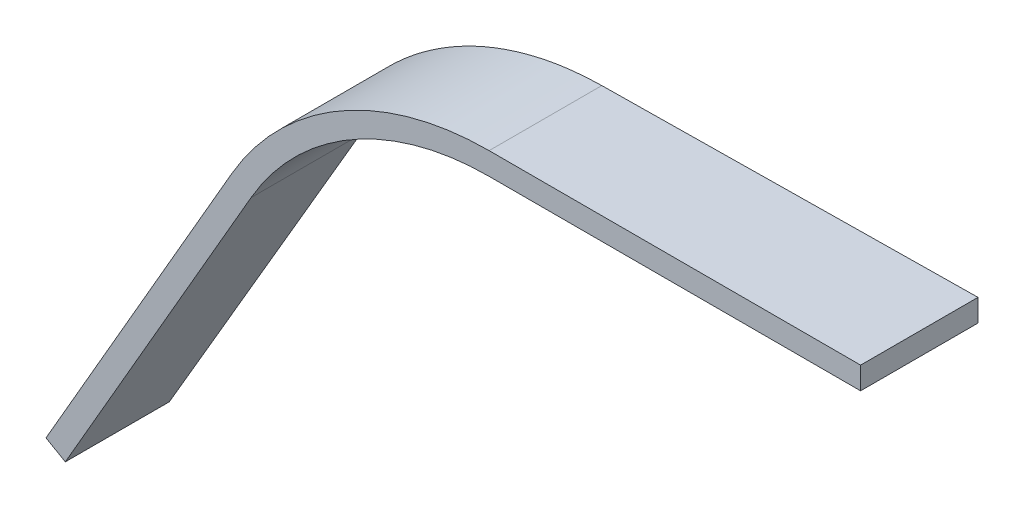
ISO-10303-21;
HEADER;
FILE_DESCRIPTION(('STEP AP214'),'2;1');
FILE_NAME('part.step','',(''),(''),'','','');
FILE_SCHEMA(('AUTOMOTIVE_DESIGN { 1 0 10303 214 1 1 1 1 }'));
ENDSEC;
DATA;
#1=APPLICATION_CONTEXT('core data for automotive mechanical design processes');
#2=APPLICATION_PROTOCOL_DEFINITION('international standard','automotive_design',2000,#1);
#3=PRODUCT_CONTEXT('',#1,'mechanical');
#4=PRODUCT('Part','Part','',(#3));
#5=PRODUCT_RELATED_PRODUCT_CATEGORY('part','',(#4));
#6=PRODUCT_DEFINITION_FORMATION('','',#4);
#7=PRODUCT_DEFINITION_CONTEXT('part definition',#1,'design');
#8=PRODUCT_DEFINITION('design','',#6,#7);
#9=PRODUCT_DEFINITION_SHAPE('','',#8);
#10=(LENGTH_UNIT() NAMED_UNIT(*) SI_UNIT(.MILLI.,.METRE.));
#11=(NAMED_UNIT(*) PLANE_ANGLE_UNIT() SI_UNIT($,.RADIAN.));
#12=(NAMED_UNIT(*) SI_UNIT($,.STERADIAN.) SOLID_ANGLE_UNIT());
#13=UNCERTAINTY_MEASURE_WITH_UNIT(LENGTH_MEASURE(1.E-05),#10,'distance_accuracy_value','');
#14=(GEOMETRIC_REPRESENTATION_CONTEXT(3) GLOBAL_UNCERTAINTY_ASSIGNED_CONTEXT((#13)) GLOBAL_UNIT_ASSIGNED_CONTEXT((#10,
#11,#12)) REPRESENTATION_CONTEXT('',''));
#15=CARTESIAN_POINT('',(0.,0.,0.));
#16=DIRECTION('',(0.,0.,1.));
#17=DIRECTION('',(1.,0.,0.));
#18=AXIS2_PLACEMENT_3D('',#15,#16,#17);
#19=CARTESIAN_POINT('',(0.,0.,-800.));
#20=DIRECTION('',(1.,0.,0.));
#21=DIRECTION('',(0.,0.,-1.));
#22=AXIS2_PLACEMENT_3D('',#19,#20,#21);
#23=PLANE('',#22);
#24=DIRECTION('',(0.,-1.,0.));
#25=VECTOR('',#24,1.);
#26=CARTESIAN_POINT('',(0.,50.,-790.));
#27=LINE('',#26,#25);
#28=CARTESIAN_POINT('',(0.,0.,-790.));
#29=VERTEX_POINT('',#28);
#30=CARTESIAN_POINT('',(0.,-150.,-790.));
#31=VERTEX_POINT('',#30);
#32=EDGE_CURVE('E198',#29,#31,#27,.T.);
#33=ORIENTED_EDGE('',*,*,#32,.F.);
#34=DIRECTION('',(0.,0.,1.));
#35=VECTOR('',#34,1.);
#36=CARTESIAN_POINT('',(0.,0.,-800.));
#37=LINE('',#36,#35);
#38=CARTESIAN_POINT('',(0.,0.,0.));
#39=VERTEX_POINT('',#38);
#40=EDGE_CURVE('E203',#29,#39,#37,.T.);
#41=ORIENTED_EDGE('',*,*,#40,.T.);
#42=DIRECTION('',(0.,1.,0.));
#43=VECTOR('',#42,1.);
#44=CARTESIAN_POINT('',(0.,0.,0.));
#45=LINE('',#44,#43);
#46=CARTESIAN_POINT('',(0.,-150.,0.));
#47=VERTEX_POINT('',#46);
#48=EDGE_CURVE('E316',#47,#39,#45,.T.);
#49=ORIENTED_EDGE('',*,*,#48,.F.);
#50=DIRECTION('',(0.,0.,1.));
#51=VECTOR('',#50,1.);
#52=CARTESIAN_POINT('',(0.,-150.,-800.));
#53=LINE('',#52,#51);
#54=EDGE_CURVE('E141',#31,#47,#53,.T.);
#55=ORIENTED_EDGE('',*,*,#54,.F.);
#56=EDGE_LOOP('',(#33,#41,#49,#55));
#57=FACE_BOUND('',#56,.T.);
#58=ADVANCED_FACE('F133',(#57),#23,.T.);
#59=CARTESIAN_POINT('',(0.,-150.,-800.));
#60=DIRECTION('',(0.,-1.,0.));
#61=DIRECTION('',(0.,0.,-1.));
#62=AXIS2_PLACEMENT_3D('',#59,#60,#61);
#63=PLANE('',#62);
#64=CARTESIAN_POINT('',(0.,-150.,-790.));
#65=CARTESIAN_POINT('',(-166.65278143382,-150.,-787.848670539484));
#66=CARTESIAN_POINT('',(-333.305556207496,-150.,-785.696825113689));
#67=CARTESIAN_POINT('',(-666.628494797486,-150.,-781.391796628459));
#68=CARTESIAN_POINT('',(-833.2986586123,-150.,-779.238613452802));
#69=CARTESIAN_POINT('',(-1166.63897081169,-150.,-774.931053054194));
#70=CARTESIAN_POINT('',(-1333.30911919627,-150.,-772.776675831244));
#71=CARTESIAN_POINT('',(-1583.31432927409,-150.,-769.544141929115));
#72=CARTESIAN_POINT('',(-1666.64939722604,-150.,-768.466469283669));
#73=CARTESIAN_POINT('',(-1833.3195287823,-150.,-766.310787845271));
#74=CARTESIAN_POINT('',(-1916.65459238662,-150.,-765.232779052318));
#75=CARTESIAN_POINT('',(-2041.65718439311,-150.,-763.6155030545));
#76=CARTESIAN_POINT('',(-2083.32471449543,-150.,-763.076367253828));
#77=CARTESIAN_POINT('',(-2166.65977354083,-150.,-761.998006063874));
#78=CARTESIAN_POINT('',(-2208.32730248392,-150.,-761.458780674592));
#79=CARTESIAN_POINT('',(-2270.82859501281,-150.,-760.649874153293));
#80=CARTESIAN_POINT('',(-2291.66235904149,-150.,-760.380227239964));
#81=CARTESIAN_POINT('',(-2333.32988679525,-150.,-759.840909957697));
#82=CARTESIAN_POINT('',(-2354.16365052033,-150.,-759.57123958876));
#83=CARTESIAN_POINT('',(-2385.41429589317,-150.,-759.166717437989));
#84=CARTESIAN_POINT('',(-2395.83117764834,-150.,-759.031873954837));
#85=CARTESIAN_POINT('',(-2416.66494106026,-150.,-758.762179391794));
#86=CARTESIAN_POINT('',(-2427.081822717,-150.,-758.627328311902));
#87=CARTESIAN_POINT('',(-2447.9155860391,-150.,-758.357626797609));
#88=CARTESIAN_POINT('',(-2458.33246770445,-150.,-758.222776363208));
#89=CARTESIAN_POINT('',(-2479.16623244481,-150.,-757.953184429333));
#90=CARTESIAN_POINT('',(-2489.58311551981,-150.,-757.818442929858));
#91=CARTESIAN_POINT('',(-2500.,-150.,-757.683810042567));
#92=B_SPLINE_CURVE_WITH_KNOTS('',3,(#64,#65,#66,#67,#68,#69,#70,#71,#72,#73,#74,#75,#76,#77,#78,
#79,#80,#81,#82,#83,#84,#85,#86,#87,#88,#89,#90,#91),.UNSPECIFIED.,.F.,.F.,(4,2,2,2,2,2,2,2,2,2,
2,2,2,4),(0.,500.000000002541,1000.05221460707,1500.10442920935,1750.13053656558,
2000.15664392167,2125.16969760059,2250.18275127966,2312.6892781192,2375.19580495876,
2406.44906837866,2437.70233179843,2468.95559521844,2500.20885863907),.UNSPECIFIED.);
#93=CARTESIAN_POINT('',(-2500.,-150.,-757.683810042567));
#94=VERTEX_POINT('',#93);
#95=EDGE_CURVE('E313',#31,#94,#92,.T.);
#96=ORIENTED_EDGE('',*,*,#95,.F.);
#97=ORIENTED_EDGE('',*,*,#54,.T.);
#98=DIRECTION('',(1.,0.,0.));
#99=VECTOR('',#98,1.);
#100=CARTESIAN_POINT('',(0.,-150.,0.));
#101=LINE('',#100,#99);
#102=CARTESIAN_POINT('',(-2500.,-150.,0.));
#103=VERTEX_POINT('',#102);
#104=EDGE_CURVE('E211',#103,#47,#101,.T.);
#105=ORIENTED_EDGE('',*,*,#104,.F.);
#106=DIRECTION('',(0.,0.,1.));
#107=VECTOR('',#106,1.);
#108=CARTESIAN_POINT('',(-2500.,-150.,-800.));
#109=LINE('',#108,#107);
#110=EDGE_CURVE('E314',#94,#103,#109,.T.);
#111=ORIENTED_EDGE('',*,*,#110,.F.);
#112=EDGE_LOOP('',(#96,#97,#105,#111));
#113=FACE_BOUND('',#112,.T.);
#114=ADVANCED_FACE('F303',(#113),#63,.T.);
#115=CARTESIAN_POINT('',(-2500.,-2000.,-800.));
#116=DIRECTION('',(0.,0.,1.));
#117=DIRECTION('',(1.,0.,0.));
#118=AXIS2_PLACEMENT_3D('',#115,#116,#117);
#119=CYLINDRICAL_SURFACE('',#118,1850.);
#120=CARTESIAN_POINT('',(-2500.,-150.,-757.683810042567));
#121=CARTESIAN_POINT('',(-2508.44501957596,-150.000000280646,-757.574587783803));
#122=CARTESIAN_POINT('',(-2516.8899297368,-150.057826648943,-757.465307322498));
#123=CARTESIAN_POINT('',(-2533.77816474701,-150.289116076446,-757.246639545874));
#124=CARTESIAN_POINT('',(-2542.22148959643,-150.462579132345,-757.137252230559));
#125=CARTESIAN_POINT('',(-2567.54886740005,-151.156450250679,-756.808920594767));
#126=CARTESIAN_POINT('',(-2584.42849210996,-151.850340259695,-756.589830268314));
#127=CARTESIAN_POINT('',(-2618.16383889524,-153.700262682177,-756.151286267315));
#128=CARTESIAN_POINT('',(-2635.01955843518,-154.856340902551,-755.931832558902));
#129=CARTESIAN_POINT('',(-2668.69419569834,-157.629868540049,-755.492604783782));
#130=CARTESIAN_POINT('',(-2685.5131108714,-159.247348967434,-755.272830696531));
#131=CARTESIAN_POINT('',(-2719.10089424265,-162.942500023333,-754.833007063983));
#132=CARTESIAN_POINT('',(-2735.86976065345,-165.020186892417,-754.612957509238));
#133=CARTESIAN_POINT('',(-2769.30862075072,-169.629242662846,-754.173097329216));
#134=CARTESIAN_POINT('',(-2785.97874897214,-172.159635547033,-753.953287193738));
#135=CARTESIAN_POINT('',(-2819.24290502678,-177.675060041185,-753.513480246094));
#136=CARTESIAN_POINT('',(-2835.83693601703,-180.660072611434,-753.29348344213));
#137=CARTESIAN_POINT('',(-2868.93589608343,-187.082329814447,-752.853361478186));
#138=CARTESIAN_POINT('',(-2885.44083207115,-190.51953882746,-752.633236329674));
#139=CARTESIAN_POINT('',(-2918.34868656919,-197.843379497831,-752.192931950145));
#140=CARTESIAN_POINT('',(-2934.75161665263,-201.72995915393,-751.972752728323));
#141=CARTESIAN_POINT('',(-2967.44261628873,-209.949324124388,-751.532410852545));
#142=CARTESIAN_POINT('',(-2983.73070306972,-214.282040920904,-751.312248201227));
#143=CARTESIAN_POINT('',(-3016.41370742152,-223.455866553532,-750.868830795974));
#144=CARTESIAN_POINT('',(-3032.80683842731,-228.303341675896,-750.645576698862));
#145=CARTESIAN_POINT('',(-3065.45068093315,-238.45021614496,-750.199204065231));
#146=CARTESIAN_POINT('',(-3081.70140767439,-243.749566460632,-749.976085516644));
#147=CARTESIAN_POINT('',(-3114.04929079396,-254.796411691774,-749.530036927373));
#148=CARTESIAN_POINT('',(-3130.14645166871,-260.543893440407,-749.307106881345));
#149=CARTESIAN_POINT('',(-3162.1727260888,-272.481756667715,-748.861506085237));
#150=CARTESIAN_POINT('',(-3178.10186654765,-278.672065939063,-748.638835298873));
#151=CARTESIAN_POINT('',(-3209.78293865785,-291.491820267731,-748.193663949025));
#152=CARTESIAN_POINT('',(-3225.53486528407,-298.121277741169,-747.971163390534));
#153=CARTESIAN_POINT('',(-3256.84922213007,-311.814207034783,-747.526300410159));
#154=CARTESIAN_POINT('',(-3272.41165086365,-318.87768225624,-747.303937989372));
#155=CARTESIAN_POINT('',(-3299.47014367549,-331.614016699064,-746.9148853567));
#156=CARTESIAN_POINT('',(-3311.01040846143,-337.19321335648,-746.74817083878));
#157=CARTESIAN_POINT('',(-3333.97273225568,-348.590368429954,-746.414782672726));
#158=CARTESIAN_POINT('',(-3345.39478943261,-354.408330538247,-746.248109025265));
#159=CARTESIAN_POINT('',(-3368.11515626994,-366.280207282766,-745.914796794476));
#160=CARTESIAN_POINT('',(-3379.41346965291,-372.334114795953,-745.748158210242));
#161=CARTESIAN_POINT('',(-3401.88215176707,-384.675612460369,-745.414891848154));
#162=CARTESIAN_POINT('',(-3413.05251693879,-390.96320909217,-745.248264070728));
#163=CARTESIAN_POINT('',(-3435.26014801822,-403.769205735022,-744.915009918411));
#164=CARTESIAN_POINT('',(-3446.29741398768,-410.287605638963,-744.74838354352));
#165=CARTESIAN_POINT('',(-3468.23377545843,-423.552208167333,-744.41512367989));
#166=CARTESIAN_POINT('',(-3479.13287478565,-430.298404464859,-744.248490191477));
#167=CARTESIAN_POINT('',(-3500.78885277585,-444.016078287777,-743.915192680333));
#168=CARTESIAN_POINT('',(-3511.54572713172,-450.987562613822,-743.748528656831));
#169=CARTESIAN_POINT('',(-3532.91203419409,-465.152443457369,-743.415164802204));
#170=CARTESIAN_POINT('',(-3543.52146917886,-472.345836540349,-743.248464971672));
#171=CARTESIAN_POINT('',(-3568.0986364354,-489.385122679534,-742.859453086746));
#172=CARTESIAN_POINT('',(-3582.00744492135,-499.316187574109,-742.637118804662));
#173=CARTESIAN_POINT('',(-3609.54433974783,-519.559733305196,-742.192321330745));
#174=CARTESIAN_POINT('',(-3623.17242830656,-529.87221112606,-741.969858139946));
#175=CARTESIAN_POINT('',(-3650.13728107955,-550.870526279354,-741.524769986233));
#176=CARTESIAN_POINT('',(-3663.47405359974,-561.556352944302,-741.302145028118));
#177=CARTESIAN_POINT('',(-3689.84856425793,-583.295199726259,-740.856640607854));
#178=CARTESIAN_POINT('',(-3702.8862529562,-594.348279822806,-740.633761109932));
#179=CARTESIAN_POINT('',(-3728.65070937081,-616.81181784544,-740.187789081354));
#180=CARTESIAN_POINT('',(-3741.37746785744,-628.222286357423,-739.964696544578));
#181=CARTESIAN_POINT('',(-3766.51126595696,-651.392796243888,-739.518355345018));
#182=CARTESIAN_POINT('',(-3778.91827043547,-663.152875730258,-739.295106667822));
#183=CARTESIAN_POINT('',(-3803.27575771524,-686.889760116576,-738.850835434186));
#184=CARTESIAN_POINT('',(-3815.22962183782,-698.863095588085,-738.629813579113));
#185=CARTESIAN_POINT('',(-3838.80625538214,-723.135049789584,-738.187732603472));
#186=CARTESIAN_POINT('',(-3850.42897304848,-735.43371879348,-737.966673482453));
#187=CARTESIAN_POINT('',(-3873.33396589135,-760.346751600166,-737.524590156105));
#188=CARTESIAN_POINT('',(-3884.6162010163,-772.961152226231,-737.303565957904));
#189=CARTESIAN_POINT('',(-3906.83119959085,-798.495784609057,-736.861627204233));
#190=CARTESIAN_POINT('',(-3917.76393508216,-811.416040689611,-736.64071265892));
#191=CARTESIAN_POINT('',(-3939.27121519529,-837.552238962937,-736.199060249593));
#192=CARTESIAN_POINT('',(-3949.84574459329,-850.768193683416,-735.978322393477));
#193=CARTESIAN_POINT('',(-3970.65063641479,-877.514198456699,-735.536588211086));
#194=CARTESIAN_POINT('',(-3980.8802049791,-891.044866034551,-735.315592358393));
#195=CARTESIAN_POINT('',(-4000.96302334502,-918.381930053139,-734.873864985421));
#196=CARTESIAN_POINT('',(-4010.81628658921,-932.188316617612,-734.653133455973));
#197=CARTESIAN_POINT('',(-4030.13872965416,-960.065828402428,-734.211979356742));
#198=CARTESIAN_POINT('',(-4039.60793558296,-974.136935531675,-733.991556766944));
#199=CARTESIAN_POINT('',(-4058.15503403695,-1002.53299152988,-733.551061154271));
#200=CARTESIAN_POINT('',(-4067.23296575858,-1016.85791476862,-733.330988098518));
#201=CARTESIAN_POINT('',(-4080.55107242791,-1038.52707547847,-733.001175611379));
#202=CARTESIAN_POINT('',(-4084.94040975682,-1045.78002132746,-732.891293663897));
#203=CARTESIAN_POINT('',(-4093.61896737524,-1060.34556730154,-732.671626775447));
#204=CARTESIAN_POINT('',(-4097.90818766183,-1067.65816742835,-732.561841834483));
#205=CARTESIAN_POINT('',(-4102.14699700121,-1075.,-732.45210641178));
#206=B_SPLINE_CURVE_WITH_KNOTS('',3,(#120,#121,#122,#123,#124,#125,#126,#127,#128,#129,#130,
#131,#132,#133,#134,#135,#136,#137,#138,#139,#140,#141,#142,#143,#144,#145,#146,#147,#148,#149,
#150,#151,#152,#153,#154,#155,#156,#157,#158,#159,#160,#161,#162,#163,#164,#165,#166,#167,#168,
#169,#170,#171,#172,#173,#174,#175,#176,#177,#178,#179,#180,#181,#182,#183,#184,#185,#186,#187,
#188,#189,#190,#191,#192,#193,#194,#195,#196,#197,#198,#199,#200,#201,#202,#203,#204,#205),
.UNSPECIFIED.,.F.,.F.,(4,2,2,2,2,2,2,2,2,2,2,2,2,2,2,2,2,2,2,2,2,2,2,2,2,2,2,2,2,2,2,2,2,2,2,2,
2,2,2,2,2,2,4),(0.,25.3367623213395,50.673523918344,101.352540203313,152.036580469161,
202.724027948334,253.413264459755,303.994505699963,354.573629152833,405.148770844525,
455.718065817413,506.279605897565,557.56184654724,608.838529845646,660.113707118169,
711.380542449963,762.648827877625,813.917515132445,852.372638389839,890.828356536127,
929.282914627134,967.73853992124,1006.1941473695,1044.64868761427,1083.10438975255,
1121.55949700306,1172.82810710883,1224.09631194479,1275.36305311978,1326.63820869653,
1377.91488448943,1429.19717071582,1479.95241991137,1530.71555868771,1581.48464573175,
1632.25778394822,1683.03307733176,1733.91819146943,1784.80148615827,1835.68131600684,
1886.55603699255,1911.99060131595,1937.42516637686),.UNSPECIFIED.);
#207=CARTESIAN_POINT('',(-4102.14699700121,-1075.,-732.45210641178));
#208=VERTEX_POINT('',#207);
#209=EDGE_CURVE('E276',#94,#208,#206,.T.);
#210=ORIENTED_EDGE('',*,*,#209,.F.);
#211=ORIENTED_EDGE('',*,*,#110,.T.);
#212=CARTESIAN_POINT('',(-2500.,-2000.,0.));
#213=DIRECTION('',(0.,0.,-1.));
#214=DIRECTION('',(1.,0.,0.));
#215=AXIS2_PLACEMENT_3D('',#212,#213,#214);
#216=CIRCLE('',#215,1850.);
#217=CARTESIAN_POINT('',(-4102.14699700121,-1075.,0.));
#218=VERTEX_POINT('',#217);
#219=EDGE_CURVE('E216',#218,#103,#216,.T.);
#220=ORIENTED_EDGE('',*,*,#219,.F.);
#221=DIRECTION('',(0.,0.,1.));
#222=VECTOR('',#221,1.);
#223=CARTESIAN_POINT('',(-4102.14699700121,-1075.,-800.));
#224=LINE('',#223,#222);
#225=EDGE_CURVE('E334',#208,#218,#224,.T.);
#226=ORIENTED_EDGE('',*,*,#225,.F.);
#227=EDGE_LOOP('',(#210,#211,#220,#226));
#228=FACE_BOUND('',#227,.T.);
#229=ADVANCED_FACE('F286',(#228),#119,.F.);
#230=CARTESIAN_POINT('',(-4102.14699700121,-1075.,-800.));
#231=DIRECTION('',(0.86602540378444,-0.499999999999998,0.));
#232=DIRECTION('',(0.499999999999998,0.86602540378444,0.));
#233=AXIS2_PLACEMENT_3D('',#230,#231,#232);
#234=PLANE('',#233);
#235=CARTESIAN_POINT('',(-4102.14699700121,-1075.,-732.45210641178));
#236=CARTESIAN_POINT('',(-4107.35489362477,-1084.02034155258,-732.31721499636));
#237=CARTESIAN_POINT('',(-4112.56278937097,-1093.04068158551,-732.182188239407));
#238=CARTESIAN_POINT('',(-4122.97857975319,-1111.08135972851,-731.911963615768));
#239=CARTESIAN_POINT('',(-4128.18647438922,-1120.10169783858,-731.776765749082));
#240=CARTESIAN_POINT('',(-4138.60226319657,-1138.14237325381,-731.506298479287));
#241=CARTESIAN_POINT('',(-4143.81015736789,-1147.16271055898,-731.371029076178));
#242=CARTESIAN_POINT('',(-4154.22594584282,-1165.20338539845,-731.10051062278));
#243=CARTESIAN_POINT('',(-4159.43384014643,-1174.22372293276,-730.965261572491));
#244=CARTESIAN_POINT('',(-4175.05752303539,-1201.28473549777,-730.559511107953));
#245=CARTESIAN_POINT('',(-4185.4733115992,-1219.32541049119,-730.289006380023));
#246=CARTESIAN_POINT('',(-4206.3048887835,-1255.40676057619,-729.748005643121));
#247=CARTESIAN_POINT('',(-4216.72067740398,-1273.44743566776,-729.477509634151));
#248=CARTESIAN_POINT('',(-4247.96804330788,-1327.569461016,-728.666028171816));
#249=CARTESIAN_POINT('',(-4268.79962063391,-1363.65081134649,-728.125049283023));
#250=CARTESIAN_POINT('',(-4310.46277541989,-1435.81351223941,-727.043112129456));
#251=CARTESIAN_POINT('',(-4331.29435287983,-1471.89486280184,-726.502153864682));
#252=CARTESIAN_POINT('',(-4435.46101547084,-1652.31681486434,-723.797183772426));
#253=CARTESIAN_POINT('',(-4518.79610155833,-1796.65741802102,-721.633319270813));
#254=CARTESIAN_POINT('',(-4685.46627568345,-2085.33862771207,-717.305890691383));
#255=CARTESIAN_POINT('',(-4768.80136372107,-2229.67923424645,-715.142326613566));
#256=CARTESIAN_POINT('',(-4935.47154163664,-2518.36045050276,-710.815481973723));
#257=CARTESIAN_POINT('',(-5018.80663151458,-2662.70106022469,-708.652201411696));
#258=CARTESIAN_POINT('',(-5185.47681299414,-2951.38228265401,-704.325905936222));
#259=CARTESIAN_POINT('',(-5268.81190459575,-3095.7228953614,-702.162891022774));
#260=CARTESIAN_POINT('',(-5352.14699700121,-3240.06350946111,-700.));
#261=B_SPLINE_CURVE_WITH_KNOTS('',3,(#235,#236,#237,#238,#239,#240,#241,#242,#243,#244,#245,
#246,#247,#248,#249,#250,#251,#252,#253,#254,#255,#256,#257,#258,#259,#260),.UNSPECIFIED.,.F.,
.F.,(4,2,2,2,2,2,2,2,2,2,2,2,4),(0.,31.2500000275576,62.500000052151,93.750000076147,
125.0000001008,187.500000147963,250.000000195422,375.000000289342,500.000000383372,
1000.05265503235,1500.10530968182,2000.15796433297,2500.21061898281),.UNSPECIFIED.);
#262=CARTESIAN_POINT('',(-5352.14699700121,-3240.0635094611,-700.));
#263=VERTEX_POINT('',#262);
#264=EDGE_CURVE('E275',#208,#263,#261,.T.);
#265=ORIENTED_EDGE('',*,*,#264,.F.);
#266=ORIENTED_EDGE('',*,*,#225,.T.);
#267=DIRECTION('',(0.499999999999998,0.86602540378444,0.));
#268=VECTOR('',#267,1.);
#269=CARTESIAN_POINT('',(-4102.14699700121,-1075.,0.));
#270=LINE('',#269,#268);
#271=CARTESIAN_POINT('',(-5352.14699700121,-3240.0635094611,0.));
#272=VERTEX_POINT('',#271);
#273=EDGE_CURVE('E348',#272,#218,#270,.T.);
#274=ORIENTED_EDGE('',*,*,#273,.F.);
#275=DIRECTION('',(0.,0.,1.));
#276=VECTOR('',#275,1.);
#277=CARTESIAN_POINT('',(-5352.14699700121,-3240.0635094611,-800.));
#278=LINE('',#277,#276);
#279=EDGE_CURVE('E329',#263,#272,#278,.T.);
#280=ORIENTED_EDGE('',*,*,#279,.F.);
#281=EDGE_LOOP('',(#265,#266,#274,#280));
#282=FACE_BOUND('',#281,.T.);
#283=ADVANCED_FACE('F281',(#282),#234,.T.);
#284=CARTESIAN_POINT('',(-5352.14699700121,-3240.0635094611,-800.));
#285=DIRECTION('',(-0.499999999999998,-0.86602540378444,0.));
#286=DIRECTION('',(0.86602540378444,-0.499999999999998,0.));
#287=AXIS2_PLACEMENT_3D('',#284,#285,#286);
#288=PLANE('',#287);
#289=DIRECTION('',(-0.86602540378444,0.499999999999997,0.));
#290=VECTOR('',#289,1.);
#291=CARTESIAN_POINT('',(-5330.4963619066,-3252.5635094611,-700.));
#292=LINE('',#291,#290);
#293=CARTESIAN_POINT('',(-5482.05080756887,-3165.06350946111,-700.));
#294=VERTEX_POINT('',#293);
#295=EDGE_CURVE('E205',#263,#294,#292,.T.);
#296=ORIENTED_EDGE('',*,*,#295,.F.);
#297=ORIENTED_EDGE('',*,*,#279,.T.);
#298=DIRECTION('',(0.86602540378444,-0.499999999999998,0.));
#299=VECTOR('',#298,1.);
#300=CARTESIAN_POINT('',(-5352.14699700121,-3240.0635094611,0.));
#301=LINE('',#300,#299);
#302=CARTESIAN_POINT('',(-5482.05080756887,-3165.0635094611,0.));
#303=VERTEX_POINT('',#302);
#304=EDGE_CURVE('E352',#303,#272,#301,.T.);
#305=ORIENTED_EDGE('',*,*,#304,.F.);
#306=DIRECTION('',(0.,0.,1.));
#307=VECTOR('',#306,1.);
#308=CARTESIAN_POINT('',(-5482.05080756887,-3165.0635094611,-800.));
#309=LINE('',#308,#307);
#310=EDGE_CURVE('E227',#294,#303,#309,.T.);
#311=ORIENTED_EDGE('',*,*,#310,.F.);
#312=EDGE_LOOP('',(#296,#297,#305,#311));
#313=FACE_BOUND('',#312,.T.);
#314=ADVANCED_FACE('F285',(#313),#288,.T.);
#315=CARTESIAN_POINT('',(-4232.05080756888,-1000.,-800.));
#316=DIRECTION('',(-0.86602540378444,0.499999999999998,0.));
#317=DIRECTION('',(-0.499999999999998,-0.86602540378444,0.));
#318=AXIS2_PLACEMENT_3D('',#315,#316,#317);
#319=PLANE('',#318);
#320=CARTESIAN_POINT('',(-5482.05080756887,-3165.06350946111,-700.));
#321=CARTESIAN_POINT('',(-5398.72414872261,-3020.73750271441,-702.10937903212));
#322=CARTESIAN_POINT('',(-5315.39748853089,-2876.41149363734,-704.218545468733));
#323=CARTESIAN_POINT('',(-5065.40083395608,-2443.40458619151,-710.545843859075));
#324=CARTESIAN_POINT('',(-4898.73083563097,-2154.723680995,-714.763352815774));
#325=CARTESIAN_POINT('',(-4565.39082897581,-1577.36185327291,-723.196789301896));
#326=CARTESIAN_POINT('',(-4398.72082064576,-1288.68093074733,-727.41271683132));
#327=CARTESIAN_POINT('',(-4232.05080756888,-1000.,-731.627893540732));
#328=B_SPLINE_CURVE_WITH_KNOTS('',3,(#320,#321,#322,#323,#324,#325,#326,#327),.UNSPECIFIED.,.F.,
.F.,(4,2,2,4),(0.,500.000000000407,1500.10002836203,2500.20005673845),.UNSPECIFIED.);
#329=CARTESIAN_POINT('',(-4232.05080756888,-1000.,-731.627893540732));
#330=VERTEX_POINT('',#329);
#331=EDGE_CURVE('E318',#294,#330,#328,.T.);
#332=ORIENTED_EDGE('',*,*,#331,.F.);
#333=ORIENTED_EDGE('',*,*,#310,.T.);
#334=DIRECTION('',(-0.499999999999998,-0.86602540378444,0.));
#335=VECTOR('',#334,1.);
#336=CARTESIAN_POINT('',(-4232.05080756888,-1000.,0.));
#337=LINE('',#336,#335);
#338=CARTESIAN_POINT('',(-4232.05080756888,-1000.,0.));
#339=VERTEX_POINT('',#338);
#340=EDGE_CURVE('E326',#339,#303,#337,.T.);
#341=ORIENTED_EDGE('',*,*,#340,.F.);
#342=DIRECTION('',(0.,0.,1.));
#343=VECTOR('',#342,1.);
#344=CARTESIAN_POINT('',(-4232.05080756888,-1000.,-800.));
#345=LINE('',#344,#343);
#346=EDGE_CURVE('E213',#330,#339,#345,.T.);
#347=ORIENTED_EDGE('',*,*,#346,.F.);
#348=EDGE_LOOP('',(#332,#333,#341,#347));
#349=FACE_BOUND('',#348,.T.);
#350=ADVANCED_FACE('F290',(#349),#319,.T.);
#351=CARTESIAN_POINT('',(-2500.,-2000.,-800.));
#352=DIRECTION('',(0.,0.,1.));
#353=DIRECTION('',(1.,0.,0.));
#354=AXIS2_PLACEMENT_3D('',#351,#352,#353);
#355=CYLINDRICAL_SURFACE('',#354,2000.);
#356=CARTESIAN_POINT('',(-4232.05080756888,-1000.,-731.627893540732));
#357=CARTESIAN_POINT('',(-4227.83702641885,-992.701511528982,-731.734501091569));
#358=CARTESIAN_POINT('',(-4223.57711302541,-985.429666364742,-731.84119720535));
#359=CARTESIAN_POINT('',(-4214.9657068236,-970.940407238398,-732.054764368054));
#360=CARTESIAN_POINT('',(-4210.61421401718,-963.722993275131,-732.161635416974));
#361=CARTESIAN_POINT('',(-4201.81989808268,-949.343028234427,-732.375560864749));
#362=CARTESIAN_POINT('',(-4197.37706594522,-942.180482665572,-732.482615280727));
#363=CARTESIAN_POINT('',(-4188.40123612954,-927.912174467199,-732.696778459889));
#364=CARTESIAN_POINT('',(-4183.8682384516,-920.806411837505,-732.803887223071));
#365=CARTESIAN_POINT('',(-4170.13437428097,-899.574925398634,-733.125333325887));
#366=CARTESIAN_POINT('',(-4160.79911689883,-885.535788308872,-733.339778796315));
#367=CARTESIAN_POINT('',(-4141.77625106511,-857.697511538106,-733.768910730161));
#368=CARTESIAN_POINT('',(-4132.08862482195,-843.898384027658,-733.983597205217));
#369=CARTESIAN_POINT('',(-4112.36725912171,-816.549090991705,-734.413182807585));
#370=CARTESIAN_POINT('',(-4102.3335104929,-802.998932078103,-734.628081940385));
#371=CARTESIAN_POINT('',(-4081.94302057854,-776.178279199351,-735.057709362645));
#372=CARTESIAN_POINT('',(-4071.58682509536,-762.90737024601,-735.27243737045));
#373=CARTESIAN_POINT('',(-4050.54302796671,-736.631636133234,-735.702032075845));
#374=CARTESIAN_POINT('',(-4039.85543663779,-723.626802711587,-735.916898768913));
#375=CARTESIAN_POINT('',(-4018.15599598417,-697.891846191558,-736.346737197636));
#376=CARTESIAN_POINT('',(-4007.14416572449,-685.161707017319,-736.561708926386));
#377=CARTESIAN_POINT('',(-3984.80361927267,-659.984539599471,-736.991716487147));
#378=CARTESIAN_POINT('',(-3973.47493049575,-647.537487030573,-737.206752312031));
#379=CARTESIAN_POINT('',(-3950.50832809237,-622.934732656602,-737.636825919865));
#380=CARTESIAN_POINT('',(-3938.87044999111,-610.778997682398,-737.851863699778));
#381=CARTESIAN_POINT('',(-3914.13478006294,-585.586953084197,-738.303013953152));
#382=CARTESIAN_POINT('',(-3901.00578119077,-572.58126322769,-738.539124104281));
#383=CARTESIAN_POINT('',(-3874.39358433892,-546.939894319294,-739.01122372542));
#384=CARTESIAN_POINT('',(-3860.9104174886,-534.304182953457,-739.24721320419));
#385=CARTESIAN_POINT('',(-3833.59942226753,-509.411540550517,-739.719021579021));
#386=CARTESIAN_POINT('',(-3819.77160211374,-497.15460049862,-739.95484047901));
#387=CARTESIAN_POINT('',(-3791.78347618257,-473.030211568125,-740.426203926094));
#388=CARTESIAN_POINT('',(-3777.62321493137,-461.162711033944,-740.661748505545));
#389=CARTESIAN_POINT('',(-3748.97901054176,-437.824358610144,-741.132579357786));
#390=CARTESIAN_POINT('',(-3734.49505997737,-426.35351583594,-741.36786562452));
#391=CARTESIAN_POINT('',(-3705.21467620609,-403.81740309809,-741.838238271035));
#392=CARTESIAN_POINT('',(-3690.41824097223,-392.752135766545,-742.07332464951));
#393=CARTESIAN_POINT('',(-3664.26057487166,-373.749915064082,-742.484595296838));
#394=CARTESIAN_POINT('',(-3652.96506279309,-365.722306305286,-742.660816001995));
#395=CARTESIAN_POINT('',(-3630.20939612553,-349.903416889223,-743.013190213008));
#396=CARTESIAN_POINT('',(-3618.74923899213,-342.112139890017,-743.189343717781));
#397=CARTESIAN_POINT('',(-3595.66981846177,-326.769693790291,-743.541592275959));
#398=CARTESIAN_POINT('',(-3584.05055971938,-319.218517686912,-743.71768733092));
#399=CARTESIAN_POINT('',(-3560.65728317615,-304.359075589879,-744.069846719456));
#400=CARTESIAN_POINT('',(-3548.8832610894,-297.050816343253,-744.245911052045));
#401=CARTESIAN_POINT('',(-3525.18608929061,-282.680724922215,-744.598017458025));
#402=CARTESIAN_POINT('',(-3513.26294241087,-275.618888077159,-744.774059531776));
#403=CARTESIAN_POINT('',(-3489.27279084984,-261.744741032289,-745.126135860765));
#404=CARTESIAN_POINT('',(-3477.20579017007,-254.932423913051,-745.302170116084));
#405=CARTESIAN_POINT('',(-3452.93241750867,-241.559833943547,-745.654258692472));
#406=CARTESIAN_POINT('',(-3440.7260411972,-234.999568951319,-745.830313013995));
#407=CARTESIAN_POINT('',(-3416.17983889079,-222.134281658536,-746.182449867703));
#408=CARTESIAN_POINT('',(-3403.84001496302,-215.829255411339,-746.35853239941));
#409=CARTESIAN_POINT('',(-3374.89868285624,-201.419015148927,-746.769430244409));
#410=CARTESIAN_POINT('',(-3358.24717247849,-193.413974342549,-747.004266301129));
#411=CARTESIAN_POINT('',(-3324.72902571919,-177.868467579946,-747.474065821909));
#412=CARTESIAN_POINT('',(-3307.86239132386,-170.327997338154,-747.709029284775));
#413=CARTESIAN_POINT('',(-3273.92721583082,-155.717506659198,-748.179124189787));
#414=CARTESIAN_POINT('',(-3256.85868157194,-148.647470340779,-748.414255625992));
#415=CARTESIAN_POINT('',(-3222.52901631616,-134.98171401792,-748.884783673966));
#416=CARTESIAN_POINT('',(-3205.26784913874,-128.386084909993,-749.120180327823));
#417=CARTESIAN_POINT('',(-3170.56875216686,-115.675464248699,-749.59124998008));
#418=CARTESIAN_POINT('',(-3153.1308161847,-109.560489586461,-749.826922987896));
#419=CARTESIAN_POINT('',(-3118.08994267709,-97.8153816281235,-750.29850638183));
#420=CARTESIAN_POINT('',(-3100.48698401019,-92.1853114221609,-750.534416794809));
#421=CARTESIAN_POINT('',(-3063.98376365759,-81.0655045989854,-751.021701668987));
#422=CARTESIAN_POINT('',(-3045.07348524979,-75.6086198807412,-751.273085561876));
#423=CARTESIAN_POINT('',(-3007.09636794292,-65.2543522270263,-751.775980028204));
#424=CARTESIAN_POINT('',(-2988.02949864958,-60.35708080178,-752.027490616895));
#425=CARTESIAN_POINT('',(-2949.75661799186,-51.1268526963748,-752.530546845194));
#426=CARTESIAN_POINT('',(-2930.55058619194,-46.7939807449074,-752.782092484402));
#427=CARTESIAN_POINT('',(-2892.01699473607,-38.6967812010682,-753.285122058342));
#428=CARTESIAN_POINT('',(-2872.68942285392,-34.93251179138,-753.536605984133));
#429=CARTESIAN_POINT('',(-2833.93049998555,-27.9761399354293,-754.039436108301));
#430=CARTESIAN_POINT('',(-2814.4991433852,-24.7840687711398,-754.290782298399));
#431=CARTESIAN_POINT('',(-2775.49710202036,-18.9671481874348,-754.793971165889));
#432=CARTESIAN_POINT('',(-2755.92618113194,-16.3438813487257,-755.045813309963));
#433=CARTESIAN_POINT('',(-2716.7162208417,-11.6781277937378,-755.549240616469));
#434=CARTESIAN_POINT('',(-2697.0771845706,-9.63561473374724,-755.80082579004));
#435=CARTESIAN_POINT('',(-2657.74860116429,-6.13313422375997,-756.303688380756));
#436=CARTESIAN_POINT('',(-2638.05905852915,-4.6731165723634,-756.554965822561));
#437=CARTESIAN_POINT('',(-2608.50071258593,-2.92087961809635,-756.931596697664));
#438=CARTESIAN_POINT('',(-2598.64441706374,-2.40978011811137,-757.057086528042));
#439=CARTESIAN_POINT('',(-2578.92525588752,-1.53353719481951,-757.307984237166));
#440=CARTESIAN_POINT('',(-2569.06239023346,-1.16839377220106,-757.433392115913));
#441=CARTESIAN_POINT('',(-2549.33402108425,-0.584203953918315,-757.68405543121));
#442=CARTESIAN_POINT('',(-2539.46851831687,-0.365132871045432,-757.809310889947));
#443=CARTESIAN_POINT('',(-2519.73534786728,-0.0730283485057703,-758.059601092455));
#444=CARTESIAN_POINT('',(-2509.86768018498,5.08552677942783E-06,-758.184635836217));
#445=CARTESIAN_POINT('',(-2500.,0.,-758.309515464555));
#446=B_SPLINE_CURVE_WITH_KNOTS('',3,(#356,#357,#358,#359,#360,#361,#362,#363,#364,#365,#366,
#367,#368,#369,#370,#371,#372,#373,#374,#375,#376,#377,#378,#379,#380,#381,#382,#383,#384,#385,
#386,#387,#388,#389,#390,#391,#392,#393,#394,#395,#396,#397,#398,#399,#400,#401,#402,#403,#404,
#405,#406,#407,#408,#409,#410,#411,#412,#413,#414,#415,#416,#417,#418,#419,#420,#421,#422,#423,
#424,#425,#426,#427,#428,#429,#430,#431,#432,#433,#434,#435,#436,#437,#438,#439,#440,#441,#442,
#443,#444,#445),.UNSPECIFIED.,.F.,.F.,(4,2,2,2,2,2,2,2,2,2,2,2,2,2,2,2,2,2,2,2,2,2,2,2,2,2,2,2,
2,2,2,2,2,2,2,2,2,2,2,2,2,2,2,2,4),(0.,25.2845423905821,50.5690842408296,75.856132143957,
101.14317996905,151.72003649264,202.299450265428,252.880205348662,303.37955734692,
353.877338845605,404.372157017168,454.862619710571,505.347306032374,560.785281232859,
616.21839994578,671.650198327821,727.074614224284,782.500302959107,837.926351331575,
879.49948734955,921.073266529413,962.645832041183,1004.21955126981,1045.79248208924,
1087.36425917644,1128.93733126522,1170.50976028246,1225.93408172313,1281.35789180928,
1336.77982990724,1392.21235872785,1447.64683468482,1503.08851227073,1562.1302850802,
1621.18380229047,1680.24617453184,1739.31458628686,1798.38622631687,1857.62017000094,
1916.85142633105,1976.07757681037,2005.68770093529,2035.29782519986,2064.90294388484,
2094.50806371202),.UNSPECIFIED.);
#447=CARTESIAN_POINT('',(-2500.,-3.06151588455594E-13,-758.309515464555));
#448=VERTEX_POINT('',#447);
#449=EDGE_CURVE('E148',#330,#448,#446,.T.);
#450=ORIENTED_EDGE('',*,*,#449,.F.);
#451=ORIENTED_EDGE('',*,*,#346,.T.);
#452=CARTESIAN_POINT('',(-2500.,-2000.,0.));
#453=DIRECTION('',(0.,0.,1.));
#454=DIRECTION('',(1.,0.,0.));
#455=AXIS2_PLACEMENT_3D('',#452,#453,#454);
#456=CIRCLE('',#455,2000.);
#457=CARTESIAN_POINT('',(-2500.,-3.06151588455594E-13,0.));
#458=VERTEX_POINT('',#457);
#459=EDGE_CURVE('E357',#458,#339,#456,.T.);
#460=ORIENTED_EDGE('',*,*,#459,.F.);
#461=DIRECTION('',(0.,0.,1.));
#462=VECTOR('',#461,1.);
#463=CARTESIAN_POINT('',(-2500.,-3.06151588455594E-13,-800.));
#464=LINE('',#463,#462);
#465=EDGE_CURVE('E210',#448,#458,#464,.T.);
#466=ORIENTED_EDGE('',*,*,#465,.F.);
#467=EDGE_LOOP('',(#450,#451,#460,#466));
#468=FACE_BOUND('',#467,.T.);
#469=ADVANCED_FACE('F294',(#468),#355,.T.);
#470=CARTESIAN_POINT('',(0.,0.,-800.));
#471=DIRECTION('',(0.,1.,0.));
#472=DIRECTION('',(-1.,0.,0.));
#473=AXIS2_PLACEMENT_3D('',#470,#471,#472);
#474=PLANE('',#473);
#475=CARTESIAN_POINT('',(-2500.,-3.02439890080726E-13,-758.309515464555));
#476=CARTESIAN_POINT('',(-2416.67334448283,-2.92714178609091E-13,-759.364468181877));
#477=CARTESIAN_POINT('',(-2333.34669095292,-2.8403911664622E-13,-760.419577855843));
#478=CARTESIAN_POINT('',(-2166.69338763814,-2.67038650623538E-13,-762.530092774811));
#479=CARTESIAN_POINT('',(-2083.36673785328,-2.5871324656372E-13,-763.585498019812));
#480=CARTESIAN_POINT('',(-1666.70002551896,-2.13577642345822E-13,-768.863641327269));
#481=CARTESIAN_POINT('',(-1333.35998931333,-1.66250315288752E-13,-773.0884590514));
#482=CARTESIAN_POINT('',(-666.679962796633,0.,-781.541716581801));
#483=CARTESIAN_POINT('',(-333.339972485569,0.,-785.770156388071));
#484=CARTESIAN_POINT('',(0.,0.,-790.000000000001));
#485=B_SPLINE_CURVE_WITH_KNOTS('',3,(#475,#476,#477,#478,#479,#480,#481,#482,#483,#484),
.UNSPECIFIED.,.F.,.F.,(4,2,2,2,4),(0.,250.000000008086,500.000000010432,1500.10042464436,
2500.20084937017),.UNSPECIFIED.);
#486=EDGE_CURVE('E13',#448,#29,#485,.T.);
#487=ORIENTED_EDGE('',*,*,#486,.F.);
#488=ORIENTED_EDGE('',*,*,#465,.T.);
#489=DIRECTION('',(-1.,0.,0.));
#490=VECTOR('',#489,1.);
#491=CARTESIAN_POINT('',(0.,0.,0.));
#492=LINE('',#491,#490);
#493=EDGE_CURVE('E208',#39,#458,#492,.T.);
#494=ORIENTED_EDGE('',*,*,#493,.F.);
#495=ORIENTED_EDGE('',*,*,#40,.F.);
#496=EDGE_LOOP('',(#487,#488,#494,#495));
#497=FACE_BOUND('',#496,.T.);
#498=ADVANCED_FACE('F206',(#497),#474,.T.);
#499=CARTESIAN_POINT('',(-2500.,-2000.,0.));
#500=DIRECTION('',(0.,0.,1.));
#501=DIRECTION('',(1.,0.,0.));
#502=AXIS2_PLACEMENT_3D('',#499,#500,#501);
#503=PLANE('',#502);
#504=ORIENTED_EDGE('',*,*,#48,.T.);
#505=ORIENTED_EDGE('',*,*,#493,.T.);
#506=ORIENTED_EDGE('',*,*,#459,.T.);
#507=ORIENTED_EDGE('',*,*,#340,.T.);
#508=ORIENTED_EDGE('',*,*,#304,.T.);
#509=ORIENTED_EDGE('',*,*,#273,.T.);
#510=ORIENTED_EDGE('',*,*,#219,.T.);
#511=ORIENTED_EDGE('',*,*,#104,.T.);
#512=EDGE_LOOP('',(#504,#505,#506,#507,#508,#509,#510,#511));
#513=FACE_BOUND('',#512,.T.);
#514=ADVANCED_FACE('F237',(#513),#503,.T.);
#515=CARTESIAN_POINT('',(0.,-200.,-790.));
#516=CARTESIAN_POINT('',(-812.876412098434,-194.519007837779,-779.446095901806));
#517=CARTESIAN_POINT('',(-1625.71019705785,-189.073795411942,-768.892191803614));
#518=CARTESIAN_POINT('',(-2456.96215197623,-183.528249118635,-758.098335095033));
#519=CARTESIAN_POINT('',(-2475.43828228597,-183.438880419922,-757.85838248465));
#520=CARTESIAN_POINT('',(-2601.84998436051,-183.057270317422,-756.216382110459));
#521=CARTESIAN_POINT('',(-2810.33153564493,-200.81203967182,-753.492270786306));
#522=CARTESIAN_POINT('',(-3017.66077028912,-254.507245023715,-750.688175258691));
#523=CARTESIAN_POINT('',(-3219.37931054623,-326.041294548512,-747.884079731076));
#524=CARTESIAN_POINT('',(-3420.61678069324,-418.976698461712,-745.));
#525=CARTESIAN_POINT('',(-3602.38992654558,-545.61402343213,-742.115920268924));
#526=CARTESIAN_POINT('',(-3765.84220827773,-683.39475829319,-739.311824741309));
#527=CARTESIAN_POINT('',(-3916.64314011804,-834.94678187953,-736.507729213694));
#528=CARTESIAN_POINT('',(-4036.87014107176,-1005.49232955555,-733.783617889541));
#529=CARTESIAN_POINT('',(-4100.11048272969,-1114.47552477302,-732.14161751535));
#530=CARTESIAN_POINT('',(-4109.32432678085,-1130.42089823456,-731.901664904967));
#531=CARTESIAN_POINT('',(-4522.50888739484,-1848.50715329404,-721.107808196393));
#532=CARTESIAN_POINT('',(-4926.49661812126,-2550.56424686473,-710.553904098194));
#533=CARTESIAN_POINT('',(-5330.4963619066,-3252.5635094611,-700.));
#534=CARTESIAN_POINT('',(0.,-179.166666666667,-790.));
#535=CARTESIAN_POINT('',(-814.796979116984,-174.736219946379,-779.446095901806));
#536=CARTESIAN_POINT('',(-1629.53600589246,-170.35441640389,-768.892191803614));
#537=CARTESIAN_POINT('',(-2462.71410571156,-165.904893715539,-758.098335095033));
#538=CARTESIAN_POINT('',(-2481.2319261816,-165.852870301168,-757.85838248465));
#539=CARTESIAN_POINT('',(-2607.92096901279,-165.814845106356,-756.216382110459));
#540=CARTESIAN_POINT('',(-2816.84358300835,-184.104830754457,-753.492270786306));
#541=CARTESIAN_POINT('',(-3024.61577967231,-238.290526262198,-750.688175258691));
#542=CARTESIAN_POINT('',(-3226.77889994639,-310.285518942643,-747.884079731076));
#543=CARTESIAN_POINT('',(-3428.4712061649,-403.660028627473,-745.));
#544=CARTESIAN_POINT('',(-3610.72785246672,-530.682756731648,-742.115920268924));
#545=CARTESIAN_POINT('',(-3774.67773419792,-668.820946375509,-739.311824741309));
#546=CARTESIAN_POINT('',(-3925.99823950859,-820.711684057618,-736.507729213694));
#547=CARTESIAN_POINT('',(-4046.78382151594,-991.56352307931,-733.783617889541));
#548=CARTESIAN_POINT('',(-4110.38375679173,-1100.72942959221,-732.14161751535));
#549=CARTESIAN_POINT('',(-4119.63953177836,-1116.70885220305,-731.901664904967));
#550=CARTESIAN_POINT('',(-4534.21894108162,-1836.63801557916,-721.107808196393));
#551=CARTESIAN_POINT('',(-4939.56636387705,-2540.47340696431,-710.553904098194));
#552=CARTESIAN_POINT('',(-5344.93011863634,-3244.23017612777,-700.));
#553=CARTESIAN_POINT('',(0.,-137.5,-790.000000000001));
#554=CARTESIAN_POINT('',(-818.731309792241,-134.982887172088,-779.446095901807));
#555=CARTESIAN_POINT('',(-1637.36917553005,-132.544208030124,-768.892191803615));
#556=CARTESIAN_POINT('',(-2474.48284852374,-130.101528088556,-758.098335095034));
#557=CARTESIAN_POINT('',(-2493.08543264496,-130.125912187559,-757.858382484651));
#558=CARTESIAN_POINT('',(-2620.33509731901,-130.826406675514,-756.21638211046));
#559=CARTESIAN_POINT('',(-2830.14130975598,-150.256377063014,-753.492270786306));
#560=CARTESIAN_POINT('',(-3038.79622059325,-205.467499992558,-750.688175258691));
#561=CARTESIAN_POINT('',(-3241.84626433702,-278.4156027637,-747.884079731076));
#562=CARTESIAN_POINT('',(-3444.44510004117,-372.684798974665,-745.));
#563=CARTESIAN_POINT('',(-3627.6787392948,-500.470777513823,-742.115920268924));
#564=CARTESIAN_POINT('',(-3792.64612566808,-639.308911988342,-739.311824741309));
#565=CARTESIAN_POINT('',(-3945.03816122881,-791.853847957793,-736.507729213695));
#566=CARTESIAN_POINT('',(-4066.99674506964,-963.285639137271,-733.783617889541));
#567=CARTESIAN_POINT('',(-4131.35989751404,-1072.79652996625,-732.14161751535));
#568=CARTESIAN_POINT('',(-4140.70119629036,-1088.84437576935,-731.901664904967));
#569=CARTESIAN_POINT('',(-4557.92481416858,-1812.61563506554,-721.107808196392));
#570=CARTESIAN_POINT('',(-4965.84805606355,-2520.15295865094,-710.553904098194));
#571=CARTESIAN_POINT('',(-5373.79763209583,-3227.56350946111,-700.));
#572=CARTESIAN_POINT('',(0.,-75.,-789.999999999999));
#573=CARTESIAN_POINT('',(-824.723254686833,-75.0662436963894,-779.446095901805));
#574=CARTESIAN_POINT('',(-1649.3033875351,-75.2526188811558,-768.892191803613));
#575=CARTESIAN_POINT('',(-2492.42177279775,-75.5220259245215,-758.098335095033));
#576=CARTESIAN_POINT('',(-2511.15326295754,-75.6631182479275,-757.85838248465));
#577=CARTESIAN_POINT('',(-2639.25087500461,-77.5451493539829,-756.216382110459));
#578=CARTESIAN_POINT('',(-2850.38253969852,-98.7840839144962,-753.492270786305));
#579=CARTESIAN_POINT('',(-3060.35578069221,-155.594739578436,-750.68817525869));
#580=CARTESIAN_POINT('',(-3264.73322263748,-230.014423033039,-747.884079731076));
#581=CARTESIAN_POINT('',(-3468.68882783269,-325.645819700533,-745.));
#582=CARTESIAN_POINT('',(-3653.4059009646,-454.561466647303,-742.115920268924));
#583=CARTESIAN_POINT('',(-3819.93701077252,-594.424073717555,-739.311824741309));
#584=CARTESIAN_POINT('',(-3973.98994966971,-747.91333534877,-736.507729213695));
#585=CARTESIAN_POINT('',(-4097.79756145388,-920.164968902838,-733.783617889541));
#586=CARTESIAN_POINT('',(-4163.37543020904,-1030.16246470699,-732.14161751535));
#587=CARTESIAN_POINT('',(-4172.84809086673,-1046.31343227243,-731.901664904967));
#588=CARTESIAN_POINT('',(-4593.85012971065,-1776.09090996634,-721.107808196393));
#589=CARTESIAN_POINT('',(-5005.45434890335,-2489.42429428899,-710.553904098195));
#590=CARTESIAN_POINT('',(-5417.09890228504,-3202.5635094611,-700.000000000001));
#591=CARTESIAN_POINT('',(0.,-12.5,-790.000000000001));
#592=CARTESIAN_POINT('',(-830.616507430378,-15.1395825666511,-779.446095901807));
#593=CARTESIAN_POINT('',(-1661.06185873234,-17.9228276285381,-768.892191803615));
#594=CARTESIAN_POINT('',(-2510.13781115874,-20.8635807757616,-758.098335095034));
#595=CARTESIAN_POINT('',(-2528.99757848904,-21.120424398182,-757.858382484651));
#596=CARTESIAN_POINT('',(-2657.93934613779,-24.1774567080668,-756.21638211046));
#597=CARTESIAN_POINT('',(-2870.39215322086,-47.2146731134415,-753.492270786306));
#598=CARTESIAN_POINT('',(-3081.68187176265,-105.614303384824,-750.688175258691));
#599=CARTESIAN_POINT('',(-3287.38744759615,-181.49572727952,-747.884079731076));
#600=CARTESIAN_POINT('',(-3492.70320077951,-278.480240789575,-745.));
#601=CARTESIAN_POINT('',(-3678.90962053236,-408.517809151831,-742.115920268924));
#602=CARTESIAN_POINT('',(-3847.01247278602,-549.39889372214,-739.311824741309));
#603=CARTESIAN_POINT('',(-4002.73638101445,-703.828227189213,-736.507729213695));
#604=CARTESIAN_POINT('',(-4128.40455194954,-876.897422994353,-733.783617889541));
#605=CARTESIAN_POINT('',(-4195.2048283325,-987.38109560017,-732.14161751535));
#606=CARTESIAN_POINT('',(-4204.81001750891,-1003.63518419483,-731.901664904967));
#607=CARTESIAN_POINT('',(-4629.65115993576,-1739.43619146118,-721.107808196393));
#608=CARTESIAN_POINT('',(-5045.00154883866,-2458.61595168091,-710.553904098194));
#609=CARTESIAN_POINT('',(-5460.40017247427,-3177.56350946111,-700.));
#610=CARTESIAN_POINT('',(0.,29.1666666666667,-790.));
#611=CARTESIAN_POINT('',(-834.353453803533,24.6337855157244,-779.446095901806));
#612=CARTESIAN_POINT('',(-1668.54354675431,19.9637849525339,-768.892191803614));
#613=CARTESIAN_POINT('',(-2521.46078214485,15.0976708206867,-758.098335095034));
#614=CARTESIAN_POINT('',(-2540.4040553902,14.766333535668,-757.85838248465));
#615=CARTESIAN_POINT('',(-2669.89886133916,10.9838523715597,-756.216382110459));
#616=CARTESIAN_POINT('',(-2883.22664712807,-13.1719841169096,-753.492270786306));
#617=CARTESIAN_POINT('',(-3095.39537462652,-72.5759255561893,-750.688175258691));
#618=CARTESIAN_POINT('',(-3301.98934530319,-149.390779054848,-747.884079731076));
#619=CARTESIAN_POINT('',(-3508.21838496638,-247.251811863098,-745.));
#620=CARTESIAN_POINT('',(-3695.41362315635,-378.037136676082,-742.115920268924));
#621=CARTESIAN_POINT('',(-3864.55001807428,-519.606175885697,-739.311824741309));
#622=CARTESIAN_POINT('',(-4021.36558854234,-674.681199988296,-736.507729213695));
#623=CARTESIAN_POINT('',(-4148.22982372607,-848.325787704187,-733.783617889541));
#624=CARTESIAN_POINT('',(-4215.80869991167,-959.153588279056,-732.14161751535));
#625=CARTESIAN_POINT('',(-4225.50174615252,-975.476098599764,-731.901664904967));
#626=CARTESIAN_POINT('',(-4653.10846238879,-1715.15382413561,-721.107808196393));
#627=CARTESIAN_POINT('',(-5071.1650552161,-2438.13614687522,-710.553904098194));
#628=CARTESIAN_POINT('',(-5489.26768593375,-3160.89684279444,-700.));
#629=CARTESIAN_POINT('',(0.,50.,-790.));
#630=CARTESIAN_POINT('',(-836.14243128735,44.4299302791792,-779.446095901806));
#631=CARTESIAN_POINT('',(-1672.13503451184,38.7341000987896,-768.892191803614));
#632=CARTESIAN_POINT('',(-2526.91555466281,32.826283536757,-758.098335095034));
#633=CARTESIAN_POINT('',(-2545.89967957771,32.4588768679133,-757.85838248465));
#634=CARTESIAN_POINT('',(-2675.66677058821,28.3415246818126,-756.216382110459));
#635=CARTESIAN_POINT('',(-2889.42987259788,3.66471500384358,-753.492270786306));
#636=CARTESIAN_POINT('',(-3102.03909197167,-56.2156390886779,-750.688175258691));
#637=CARTESIAN_POINT('',(-3309.07862358096,-133.478315418496,-747.884079731076));
#638=CARTESIAN_POINT('',(-3515.76700397843,-231.766342513082,-745.));
#639=CARTESIAN_POINT('',(-3703.45362627476,-362.926741136987,-742.115920268924));
#640=CARTESIAN_POINT('',(-3873.09831320654,-504.845241668502,-739.311824741309));
#641=CARTESIAN_POINT('',(-4030.44687847135,-660.253308098994,-736.507729213695));
#642=CARTESIAN_POINT('',(-4157.88506965215,-834.201146995865,-733.783617889541));
#643=CARTESIAN_POINT('',(-4225.83379454496,-945.211087968149,-732.14161751535));
#644=CARTESIAN_POINT('',(-4235.57032723777,-961.567646460677,-731.901664904967));
#645=CARTESIAN_POINT('',(-4664.65280231961,-1703.11136187942,-721.107808196393));
#646=CARTESIAN_POINT('',(-5084.15601043254,-2427.93906931327,-710.553904098194));
#647=CARTESIAN_POINT('',(-5503.70144266349,-3152.56350946111,-700.));
#648=B_SPLINE_SURFACE_WITH_KNOTS('',3,3,((#515,#516,#517,#518,#519,#520,#521,#522,#523,#524,
#525,#526,#527,#528,#529,#530,#531,#532,#533),(#534,#535,#536,#537,#538,#539,#540,#541,#542,
#543,#544,#545,#546,#547,#548,#549,#550,#551,#552),(#553,#554,#555,#556,#557,#558,#559,#560,
#561,#562,#563,#564,#565,#566,#567,#568,#569,#570,#571),(#572,#573,#574,#575,#576,#577,#578,
#579,#580,#581,#582,#583,#584,#585,#586,#587,#588,#589,#590),(#591,#592,#593,#594,#595,#596,
#597,#598,#599,#600,#601,#602,#603,#604,#605,#606,#607,#608,#609),(#610,#611,#612,#613,#614,
#615,#616,#617,#618,#619,#620,#621,#622,#623,#624,#625,#626,#627,#628),(#629,#630,#631,#632,
#633,#634,#635,#636,#637,#638,#639,#640,#641,#642,#643,#644,#645,#646,#647)),.UNSPECIFIED.,.F.,
.F.,.F.,(4,1,1,1,4),(4,2,2,1,1,1,1,1,1,1,2,2,4),(0.0929487179487178,0.194711538461538,
0.296474358974359,0.398237179487179,0.5),(0.,0.351796803273145,0.35979522361926,
0.406530149079507,0.450598934424382,0.453265074539754,0.5,0.546734925460247,0.549401065575618,
0.593469850920494,0.640204776380741,0.648203196726854,1.),.UNSPECIFIED.);
#649=ORIENTED_EDGE('',*,*,#95,.T.);
#650=ORIENTED_EDGE('',*,*,#209,.T.);
#651=ORIENTED_EDGE('',*,*,#264,.T.);
#652=ORIENTED_EDGE('',*,*,#295,.T.);
#653=ORIENTED_EDGE('',*,*,#331,.T.);
#654=ORIENTED_EDGE('',*,*,#449,.T.);
#655=ORIENTED_EDGE('',*,*,#486,.T.);
#656=ORIENTED_EDGE('',*,*,#32,.T.);
#657=EDGE_LOOP('',(#649,#650,#651,#652,#653,#654,#655,#656));
#658=FACE_BOUND('',#657,.T.);
#659=ADVANCED_FACE('F197',(#658),#648,.F.);
#660=CLOSED_SHELL('',(#58,#114,#229,#283,#314,#350,#469,#498,#514,#659));
#661=MANIFOLD_SOLID_BREP('B2',#660);
#662=ADVANCED_BREP_SHAPE_REPRESENTATION('',(#18,#661),#14);
#663=SHAPE_DEFINITION_REPRESENTATION(#9,#662);
ENDSEC;
END-ISO-10303-21;
